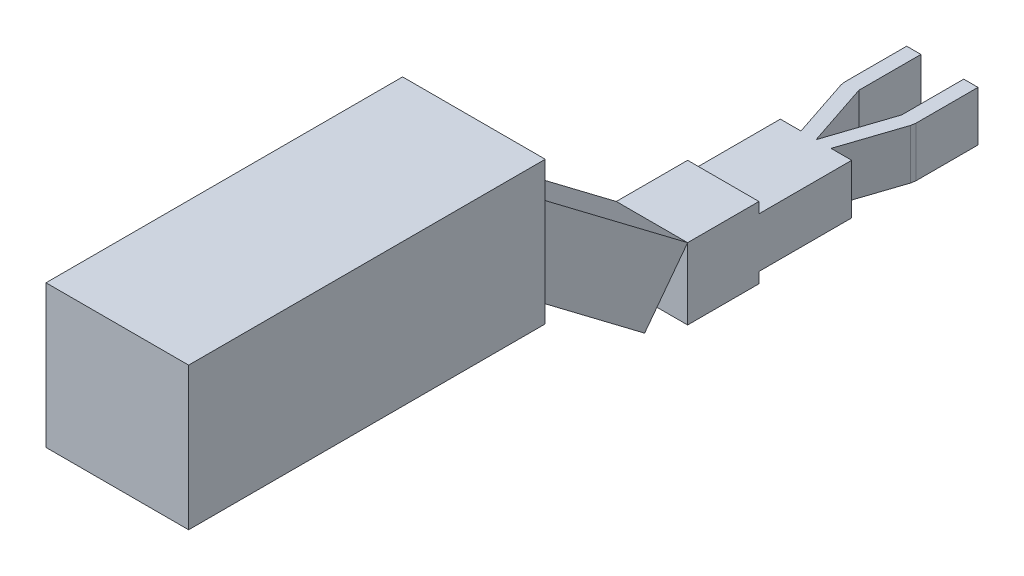
ISO-10303-21;
HEADER;
FILE_DESCRIPTION(('STEP AP214'),'2;1');
FILE_NAME('part.step','',(''),(''),'','','');
FILE_SCHEMA(('AUTOMOTIVE_DESIGN { 1 0 10303 214 1 1 1 1 }'));
ENDSEC;
DATA;
#1=APPLICATION_CONTEXT('core data for automotive mechanical design processes');
#2=APPLICATION_PROTOCOL_DEFINITION('international standard','automotive_design',2000,#1);
#3=PRODUCT_CONTEXT('',#1,'mechanical');
#4=PRODUCT('Part','Part','',(#3));
#5=PRODUCT_RELATED_PRODUCT_CATEGORY('part','',(#4));
#6=PRODUCT_DEFINITION_FORMATION('','',#4);
#7=PRODUCT_DEFINITION_CONTEXT('part definition',#1,'design');
#8=PRODUCT_DEFINITION('design','',#6,#7);
#9=PRODUCT_DEFINITION_SHAPE('','',#8);
#10=(LENGTH_UNIT() NAMED_UNIT(*) SI_UNIT(.MILLI.,.METRE.));
#11=(NAMED_UNIT(*) PLANE_ANGLE_UNIT() SI_UNIT($,.RADIAN.));
#12=(NAMED_UNIT(*) SI_UNIT($,.STERADIAN.) SOLID_ANGLE_UNIT());
#13=UNCERTAINTY_MEASURE_WITH_UNIT(LENGTH_MEASURE(1.E-05),#10,'distance_accuracy_value','');
#14=(GEOMETRIC_REPRESENTATION_CONTEXT(3) GLOBAL_UNCERTAINTY_ASSIGNED_CONTEXT((#13)) GLOBAL_UNIT_ASSIGNED_CONTEXT((#10,
#11,#12)) REPRESENTATION_CONTEXT('',''));
#15=CARTESIAN_POINT('',(0.,0.,0.));
#16=DIRECTION('',(0.,0.,1.));
#17=DIRECTION('',(1.,0.,0.));
#18=AXIS2_PLACEMENT_3D('',#15,#16,#17);
#19=CARTESIAN_POINT('',(150.,186.100667301287,635.399647205051));
#20=DIRECTION('',(0.,0.,-1.));
#21=DIRECTION('',(-1.,0.,0.));
#22=AXIS2_PLACEMENT_3D('',#19,#20,#21);
#23=PLANE('',#22);
#24=DIRECTION('',(0.,-1.,0.));
#25=VECTOR('',#24,1.);
#26=CARTESIAN_POINT('',(-50.,186.100667301287,635.399647205051));
#27=LINE('',#26,#25);
#28=CARTESIAN_POINT('',(-50.,386.100667301287,635.399647205051));
#29=VERTEX_POINT('',#28);
#30=CARTESIAN_POINT('',(-50.,186.100667301287,635.399647205051));
#31=VERTEX_POINT('',#30);
#32=EDGE_CURVE('E108',#29,#31,#27,.T.);
#33=ORIENTED_EDGE('',*,*,#32,.F.);
#34=DIRECTION('',(-1.,0.,0.));
#35=VECTOR('',#34,1.);
#36=CARTESIAN_POINT('',(150.,386.100667301287,635.399647205051));
#37=LINE('',#36,#35);
#38=CARTESIAN_POINT('',(150.,386.100667301287,635.399647205051));
#39=VERTEX_POINT('',#38);
#40=EDGE_CURVE('E12',#39,#29,#37,.T.);
#41=ORIENTED_EDGE('',*,*,#40,.F.);
#42=DIRECTION('',(0.,-1.,0.));
#43=VECTOR('',#42,1.);
#44=CARTESIAN_POINT('',(150.,186.100667301287,635.399647205051));
#45=LINE('',#44,#43);
#46=CARTESIAN_POINT('',(150.,186.100667301287,635.399647205051));
#47=VERTEX_POINT('',#46);
#48=EDGE_CURVE('E102',#39,#47,#45,.T.);
#49=ORIENTED_EDGE('',*,*,#48,.T.);
#50=DIRECTION('',(-1.,0.,0.));
#51=VECTOR('',#50,1.);
#52=CARTESIAN_POINT('',(150.,186.100667301287,635.399647205051));
#53=LINE('',#52,#51);
#54=EDGE_CURVE('E47',#47,#31,#53,.T.);
#55=ORIENTED_EDGE('',*,*,#54,.T.);
#56=EDGE_LOOP('',(#33,#41,#49,#55));
#57=FACE_BOUND('',#56,.T.);
#58=ADVANCED_FACE('F44',(#57),#23,.T.);
#59=CARTESIAN_POINT('',(150.,386.100667301287,635.399647205051));
#60=DIRECTION('',(0.,1.,0.));
#61=DIRECTION('',(-1.,0.,0.));
#62=AXIS2_PLACEMENT_3D('',#59,#60,#61);
#63=PLANE('',#62);
#64=DIRECTION('',(0.,0.,-1.));
#65=VECTOR('',#64,1.);
#66=CARTESIAN_POINT('',(-50.,386.100667301287,635.399647205051));
#67=LINE('',#66,#65);
#68=CARTESIAN_POINT('',(-49.9999999999999,386.100667301287,1135.39964720505));
#69=VERTEX_POINT('',#68);
#70=EDGE_CURVE('E104',#69,#29,#67,.T.);
#71=ORIENTED_EDGE('',*,*,#70,.F.);
#72=DIRECTION('',(-1.,0.,0.));
#73=VECTOR('',#72,1.);
#74=CARTESIAN_POINT('',(150.,386.100667301287,1135.39964720505));
#75=LINE('',#74,#73);
#76=CARTESIAN_POINT('',(150.,386.100667301287,1135.39964720505));
#77=VERTEX_POINT('',#76);
#78=EDGE_CURVE('E53',#77,#69,#75,.T.);
#79=ORIENTED_EDGE('',*,*,#78,.F.);
#80=DIRECTION('',(0.,0.,-1.));
#81=VECTOR('',#80,1.);
#82=CARTESIAN_POINT('',(150.,386.100667301287,635.399647205051));
#83=LINE('',#82,#81);
#84=EDGE_CURVE('E99',#77,#39,#83,.T.);
#85=ORIENTED_EDGE('',*,*,#84,.T.);
#86=ORIENTED_EDGE('',*,*,#40,.T.);
#87=EDGE_LOOP('',(#71,#79,#85,#86));
#88=FACE_BOUND('',#87,.T.);
#89=ADVANCED_FACE('F118',(#88),#63,.T.);
#90=CARTESIAN_POINT('',(150.,186.100667301287,1135.39964720505));
#91=DIRECTION('',(0.,0.,1.));
#92=DIRECTION('',(1.,0.,0.));
#93=AXIS2_PLACEMENT_3D('',#90,#91,#92);
#94=PLANE('',#93);
#95=DIRECTION('',(0.,1.,0.));
#96=VECTOR('',#95,1.);
#97=CARTESIAN_POINT('',(-49.9999999999999,186.100667301287,1135.39964720505));
#98=LINE('',#97,#96);
#99=CARTESIAN_POINT('',(-49.9999999999999,186.100667301287,1135.39964720505));
#100=VERTEX_POINT('',#99);
#101=EDGE_CURVE('E94',#100,#69,#98,.T.);
#102=ORIENTED_EDGE('',*,*,#101,.F.);
#103=DIRECTION('',(-1.,0.,0.));
#104=VECTOR('',#103,1.);
#105=CARTESIAN_POINT('',(150.,186.100667301287,1135.39964720505));
#106=LINE('',#105,#104);
#107=CARTESIAN_POINT('',(150.,186.100667301287,1135.39964720505));
#108=VERTEX_POINT('',#107);
#109=EDGE_CURVE('E89',#108,#100,#106,.T.);
#110=ORIENTED_EDGE('',*,*,#109,.F.);
#111=DIRECTION('',(0.,1.,0.));
#112=VECTOR('',#111,1.);
#113=CARTESIAN_POINT('',(150.,186.100667301287,1135.39964720505));
#114=LINE('',#113,#112);
#115=EDGE_CURVE('E92',#108,#77,#114,.T.);
#116=ORIENTED_EDGE('',*,*,#115,.T.);
#117=ORIENTED_EDGE('',*,*,#78,.T.);
#118=EDGE_LOOP('',(#102,#110,#116,#117));
#119=FACE_BOUND('',#118,.T.);
#120=ADVANCED_FACE('F91',(#119),#94,.T.);
#121=CARTESIAN_POINT('',(150.,186.100667301287,635.399647205051));
#122=DIRECTION('',(0.,-1.,0.));
#123=DIRECTION('',(1.,0.,0.));
#124=AXIS2_PLACEMENT_3D('',#121,#122,#123);
#125=PLANE('',#124);
#126=DIRECTION('',(0.,0.,1.));
#127=VECTOR('',#126,1.);
#128=CARTESIAN_POINT('',(-50.,186.100667301287,635.399647205051));
#129=LINE('',#128,#127);
#130=EDGE_CURVE('E111',#31,#100,#129,.T.);
#131=ORIENTED_EDGE('',*,*,#130,.F.);
#132=ORIENTED_EDGE('',*,*,#54,.F.);
#133=DIRECTION('',(0.,0.,1.));
#134=VECTOR('',#133,1.);
#135=CARTESIAN_POINT('',(150.,186.100667301287,635.399647205051));
#136=LINE('',#135,#134);
#137=EDGE_CURVE('E98',#47,#108,#136,.T.);
#138=ORIENTED_EDGE('',*,*,#137,.T.);
#139=ORIENTED_EDGE('',*,*,#109,.T.);
#140=EDGE_LOOP('',(#131,#132,#138,#139));
#141=FACE_BOUND('',#140,.T.);
#142=ADVANCED_FACE('F101',(#141),#125,.T.);
#143=CARTESIAN_POINT('',(150.,0.,0.));
#144=DIRECTION('',(1.,0.,0.));
#145=DIRECTION('',(0.,0.,-1.));
#146=AXIS2_PLACEMENT_3D('',#143,#144,#145);
#147=PLANE('',#146);
#148=ORIENTED_EDGE('',*,*,#48,.F.);
#149=ORIENTED_EDGE('',*,*,#84,.F.);
#150=ORIENTED_EDGE('',*,*,#115,.F.);
#151=ORIENTED_EDGE('',*,*,#137,.F.);
#152=EDGE_LOOP('',(#148,#149,#150,#151));
#153=FACE_BOUND('',#152,.T.);
#154=ADVANCED_FACE('F97',(#153),#147,.T.);
#155=CARTESIAN_POINT('',(-50.,0.,0.));
#156=DIRECTION('',(1.,0.,0.));
#157=DIRECTION('',(0.,0.,-1.));
#158=AXIS2_PLACEMENT_3D('',#155,#156,#157);
#159=PLANE('',#158);
#160=ORIENTED_EDGE('',*,*,#32,.T.);
#161=ORIENTED_EDGE('',*,*,#130,.T.);
#162=ORIENTED_EDGE('',*,*,#101,.T.);
#163=ORIENTED_EDGE('',*,*,#70,.T.);
#164=EDGE_LOOP('',(#160,#161,#162,#163));
#165=FACE_BOUND('',#164,.T.);
#166=ADVANCED_FACE('F117',(#165),#159,.F.);
#167=CLOSED_SHELL('',(#58,#89,#120,#142,#154,#166));
#168=MANIFOLD_SOLID_BREP('B2',#167);
#169=CARTESIAN_POINT('',(50.,85.,335.768782521129));
#170=DIRECTION('',(0.,0.797791926750478,-0.602932866587782));
#171=DIRECTION('',(0.,0.602932866587782,0.797791926750478));
#172=AXIS2_PLACEMENT_3D('',#169,#170,#171);
#173=PLANE('',#172);
#174=DIRECTION('',(0.,-0.602932866587782,-0.797791926750478));
#175=VECTOR('',#174,1.);
#176=CARTESIAN_POINT('',(-50.,85.,335.768782521129));
#177=LINE('',#176,#175);
#178=CARTESIAN_POINT('',(-50.,265.879859976335,575.106360546273));
#179=VERTEX_POINT('',#178);
#180=CARTESIAN_POINT('',(-50.,85.,335.768782521129));
#181=VERTEX_POINT('',#180);
#182=EDGE_CURVE('E241',#179,#181,#177,.T.);
#183=ORIENTED_EDGE('',*,*,#182,.F.);
#184=DIRECTION('',(-1.,0.,0.));
#185=VECTOR('',#184,1.);
#186=CARTESIAN_POINT('',(50.,265.879859976335,575.106360546273));
#187=LINE('',#186,#185);
#188=CARTESIAN_POINT('',(50.,265.879859976335,575.106360546273));
#189=VERTEX_POINT('',#188);
#190=EDGE_CURVE('E42',#189,#179,#187,.T.);
#191=ORIENTED_EDGE('',*,*,#190,.F.);
#192=DIRECTION('',(0.,-0.602932866587782,-0.797791926750478));
#193=VECTOR('',#192,1.);
#194=CARTESIAN_POINT('',(50.,85.,335.768782521129));
#195=LINE('',#194,#193);
#196=CARTESIAN_POINT('',(50.,85.,335.768782521129));
#197=VERTEX_POINT('',#196);
#198=EDGE_CURVE('E235',#189,#197,#195,.T.);
#199=ORIENTED_EDGE('',*,*,#198,.T.);
#200=DIRECTION('',(-1.,0.,0.));
#201=VECTOR('',#200,1.);
#202=CARTESIAN_POINT('',(50.,85.,335.768782521129));
#203=LINE('',#202,#201);
#204=EDGE_CURVE('E180',#197,#181,#203,.T.);
#205=ORIENTED_EDGE('',*,*,#204,.T.);
#206=EDGE_LOOP('',(#183,#191,#199,#205));
#207=FACE_BOUND('',#206,.T.);
#208=ADVANCED_FACE('F177',(#207),#173,.T.);
#209=CARTESIAN_POINT('',(50.,265.879859976335,575.106360546273));
#210=DIRECTION('',(0.,0.602932866587782,0.797791926750478));
#211=DIRECTION('',(0.,-0.797791926750478,0.602932866587782));
#212=AXIS2_PLACEMENT_3D('',#209,#210,#211);
#213=PLANE('',#212);
#214=DIRECTION('',(0.,0.797791926750478,-0.602932866587782));
#215=VECTOR('',#214,1.);
#216=CARTESIAN_POINT('',(-50.,265.879859976335,575.106360546273));
#217=LINE('',#216,#215);
#218=CARTESIAN_POINT('',(-50.,186.100667301287,635.399647205051));
#219=VERTEX_POINT('',#218);
#220=EDGE_CURVE('E237',#219,#179,#217,.T.);
#221=ORIENTED_EDGE('',*,*,#220,.F.);
#222=DIRECTION('',(-1.,0.,0.));
#223=VECTOR('',#222,1.);
#224=CARTESIAN_POINT('',(50.0000000000001,186.100667301287,635.399647205051));
#225=LINE('',#224,#223);
#226=CARTESIAN_POINT('',(50.0000000000001,186.100667301287,635.399647205051));
#227=VERTEX_POINT('',#226);
#228=EDGE_CURVE('E186',#227,#219,#225,.T.);
#229=ORIENTED_EDGE('',*,*,#228,.F.);
#230=DIRECTION('',(0.,0.797791926750478,-0.602932866587782));
#231=VECTOR('',#230,1.);
#232=CARTESIAN_POINT('',(50.,265.879859976335,575.106360546273));
#233=LINE('',#232,#231);
#234=EDGE_CURVE('E232',#227,#189,#233,.T.);
#235=ORIENTED_EDGE('',*,*,#234,.T.);
#236=ORIENTED_EDGE('',*,*,#190,.T.);
#237=EDGE_LOOP('',(#221,#229,#235,#236));
#238=FACE_BOUND('',#237,.T.);
#239=ADVANCED_FACE('F251',(#238),#213,.T.);
#240=CARTESIAN_POINT('',(50.,5.22080732495214,396.062069179907));
#241=DIRECTION('',(0.,-0.797791926750478,0.602932866587782));
#242=DIRECTION('',(0.,-0.602932866587782,-0.797791926750478));
#243=AXIS2_PLACEMENT_3D('',#240,#241,#242);
#244=PLANE('',#243);
#245=DIRECTION('',(0.,0.602932866587782,0.797791926750478));
#246=VECTOR('',#245,1.);
#247=CARTESIAN_POINT('',(-50.,5.22080732495214,396.062069179907));
#248=LINE('',#247,#246);
#249=CARTESIAN_POINT('',(-50.,5.22080732495214,396.062069179907));
#250=VERTEX_POINT('',#249);
#251=EDGE_CURVE('E227',#250,#219,#248,.T.);
#252=ORIENTED_EDGE('',*,*,#251,.F.);
#253=DIRECTION('',(-1.,0.,0.));
#254=VECTOR('',#253,1.);
#255=CARTESIAN_POINT('',(50.,5.22080732495214,396.062069179907));
#256=LINE('',#255,#254);
#257=CARTESIAN_POINT('',(50.,5.22080732495214,396.062069179907));
#258=VERTEX_POINT('',#257);
#259=EDGE_CURVE('E222',#258,#250,#256,.T.);
#260=ORIENTED_EDGE('',*,*,#259,.F.);
#261=DIRECTION('',(0.,0.602932866587782,0.797791926750478));
#262=VECTOR('',#261,1.);
#263=CARTESIAN_POINT('',(50.,5.22080732495214,396.062069179907));
#264=LINE('',#263,#262);
#265=EDGE_CURVE('E225',#258,#227,#264,.T.);
#266=ORIENTED_EDGE('',*,*,#265,.T.);
#267=ORIENTED_EDGE('',*,*,#228,.T.);
#268=EDGE_LOOP('',(#252,#260,#266,#267));
#269=FACE_BOUND('',#268,.T.);
#270=ADVANCED_FACE('F224',(#269),#244,.T.);
#271=CARTESIAN_POINT('',(50.,85.,335.768782521129));
#272=DIRECTION('',(0.,-0.602932866587781,-0.797791926750478));
#273=DIRECTION('',(0.,0.797791926750478,-0.602932866587781));
#274=AXIS2_PLACEMENT_3D('',#271,#272,#273);
#275=PLANE('',#274);
#276=DIRECTION('',(0.,-0.797791926750478,0.602932866587781));
#277=VECTOR('',#276,1.);
#278=CARTESIAN_POINT('',(-50.,85.,335.768782521129));
#279=LINE('',#278,#277);
#280=EDGE_CURVE('E244',#181,#250,#279,.T.);
#281=ORIENTED_EDGE('',*,*,#280,.F.);
#282=ORIENTED_EDGE('',*,*,#204,.F.);
#283=DIRECTION('',(0.,-0.797791926750478,0.602932866587781));
#284=VECTOR('',#283,1.);
#285=CARTESIAN_POINT('',(50.,85.,335.768782521129));
#286=LINE('',#285,#284);
#287=EDGE_CURVE('E231',#197,#258,#286,.T.);
#288=ORIENTED_EDGE('',*,*,#287,.T.);
#289=ORIENTED_EDGE('',*,*,#259,.T.);
#290=EDGE_LOOP('',(#281,#282,#288,#289));
#291=FACE_BOUND('',#290,.T.);
#292=ADVANCED_FACE('F234',(#291),#275,.T.);
#293=CARTESIAN_POINT('',(50.,0.,0.));
#294=DIRECTION('',(1.,0.,0.));
#295=DIRECTION('',(0.,0.,-1.));
#296=AXIS2_PLACEMENT_3D('',#293,#294,#295);
#297=PLANE('',#296);
#298=ORIENTED_EDGE('',*,*,#198,.F.);
#299=ORIENTED_EDGE('',*,*,#234,.F.);
#300=ORIENTED_EDGE('',*,*,#265,.F.);
#301=ORIENTED_EDGE('',*,*,#287,.F.);
#302=EDGE_LOOP('',(#298,#299,#300,#301));
#303=FACE_BOUND('',#302,.T.);
#304=ADVANCED_FACE('F230',(#303),#297,.T.);
#305=CARTESIAN_POINT('',(-50.,0.,0.));
#306=DIRECTION('',(1.,0.,0.));
#307=DIRECTION('',(0.,0.,-1.));
#308=AXIS2_PLACEMENT_3D('',#305,#306,#307);
#309=PLANE('',#308);
#310=ORIENTED_EDGE('',*,*,#182,.T.);
#311=ORIENTED_EDGE('',*,*,#280,.T.);
#312=ORIENTED_EDGE('',*,*,#251,.T.);
#313=ORIENTED_EDGE('',*,*,#220,.T.);
#314=EDGE_LOOP('',(#310,#311,#312,#313));
#315=FACE_BOUND('',#314,.T.);
#316=ADVANCED_FACE('F250',(#315),#309,.F.);
#317=CLOSED_SHELL('',(#208,#239,#270,#292,#304,#316));
#318=MANIFOLD_SOLID_BREP('B6',#317);
#319=CARTESIAN_POINT('',(-50.,70.,-71.3699993654707));
#320=DIRECTION('',(1.,0.,0.));
#321=DIRECTION('',(0.,0.,-1.));
#322=AXIS2_PLACEMENT_3D('',#319,#320,#321);
#323=PLANE('',#322);
#324=DIRECTION('',(0.,0.,1.));
#325=VECTOR('',#324,1.);
#326=CARTESIAN_POINT('',(-50.,0.,-71.3699993654707));
#327=LINE('',#326,#325);
#328=CARTESIAN_POINT('',(-50.,0.,-71.3699993654707));
#329=VERTEX_POINT('',#328);
#330=CARTESIAN_POINT('',(-50.,0.,15.6300006345293));
#331=VERTEX_POINT('',#330);
#332=EDGE_CURVE('E447',#329,#331,#327,.T.);
#333=ORIENTED_EDGE('',*,*,#332,.T.);
#334=DIRECTION('',(0.,-1.,0.));
#335=VECTOR('',#334,1.);
#336=CARTESIAN_POINT('',(-50.,70.,15.6300006345293));
#337=LINE('',#336,#335);
#338=CARTESIAN_POINT('',(-50.,70.,15.6300006345293));
#339=VERTEX_POINT('',#338);
#340=EDGE_CURVE('E175',#339,#331,#337,.T.);
#341=ORIENTED_EDGE('',*,*,#340,.F.);
#342=DIRECTION('',(0.,0.,1.));
#343=VECTOR('',#342,1.);
#344=CARTESIAN_POINT('',(-50.,70.,-71.3699993654707));
#345=LINE('',#344,#343);
#346=CARTESIAN_POINT('',(-50.,70.,-71.3699993654707));
#347=VERTEX_POINT('',#346);
#348=EDGE_CURVE('E497',#347,#339,#345,.T.);
#349=ORIENTED_EDGE('',*,*,#348,.F.);
#350=DIRECTION('',(0.,-1.,0.));
#351=VECTOR('',#350,1.);
#352=CARTESIAN_POINT('',(-50.,70.,-71.3699993654707));
#353=LINE('',#352,#351);
#354=EDGE_CURVE('E443',#347,#329,#353,.T.);
#355=ORIENTED_EDGE('',*,*,#354,.T.);
#356=EDGE_LOOP('',(#333,#341,#349,#355));
#357=FACE_BOUND('',#356,.T.);
#358=ADVANCED_FACE('F301',(#357),#323,.F.);
#359=CARTESIAN_POINT('',(-48.9765856603368,70.,21.9457901082135));
#360=DIRECTION('',(0.98712443061066,0.,-0.159954238742149));
#361=DIRECTION('',(-0.159954238742149,0.,-0.98712443061066));
#362=AXIS2_PLACEMENT_3D('',#359,#360,#361);
#363=PLANE('',#362);
#364=DIRECTION('',(0.159954238742149,0.,0.98712443061066));
#365=VECTOR('',#364,1.);
#366=CARTESIAN_POINT('',(-48.9765856603368,0.,21.9457901082135));
#367=LINE('',#366,#365);
#368=CARTESIAN_POINT('',(-48.9765856603368,0.,21.9457901082135));
#369=VERTEX_POINT('',#368);
#370=EDGE_CURVE('E450',#331,#369,#367,.T.);
#371=ORIENTED_EDGE('',*,*,#370,.T.);
#372=DIRECTION('',(0.,-1.,0.));
#373=VECTOR('',#372,1.);
#374=CARTESIAN_POINT('',(-48.9765856603368,70.,21.9457901082135));
#375=LINE('',#374,#373);
#376=CARTESIAN_POINT('',(-48.9765856603368,70.,21.9457901082135));
#377=VERTEX_POINT('',#376);
#378=EDGE_CURVE('E310',#377,#369,#375,.T.);
#379=ORIENTED_EDGE('',*,*,#378,.F.);
#380=DIRECTION('',(0.159954238742149,0.,0.98712443061066));
#381=VECTOR('',#380,1.);
#382=CARTESIAN_POINT('',(-48.9765856603368,70.,21.9457901082135));
#383=LINE('',#382,#381);
#384=EDGE_CURVE('E384',#339,#377,#383,.T.);
#385=ORIENTED_EDGE('',*,*,#384,.F.);
#386=ORIENTED_EDGE('',*,*,#340,.T.);
#387=EDGE_LOOP('',(#371,#379,#385,#386));
#388=FACE_BOUND('',#387,.T.);
#389=ADVANCED_FACE('F578',(#388),#363,.F.);
#390=CARTESIAN_POINT('',(-21.0786074565587,70.,105.768782521129));
#391=DIRECTION('',(0.948829283016839,0.,-0.315789473684211));
#392=DIRECTION('',(-0.315789473684211,0.,-0.948829283016839));
#393=AXIS2_PLACEMENT_3D('',#390,#391,#392);
#394=PLANE('',#393);
#395=DIRECTION('',(0.31578947368421,0.,0.948829283016839));
#396=VECTOR('',#395,1.);
#397=CARTESIAN_POINT('',(-21.0786074565587,0.,105.768782521129));
#398=LINE('',#397,#396);
#399=CARTESIAN_POINT('',(-21.0786074565587,0.,105.768782521129));
#400=VERTEX_POINT('',#399);
#401=EDGE_CURVE('E453',#369,#400,#398,.T.);
#402=ORIENTED_EDGE('',*,*,#401,.T.);
#403=DIRECTION('',(0.,-1.,0.));
#404=VECTOR('',#403,1.);
#405=CARTESIAN_POINT('',(-21.0786074565587,70.,105.768782521129));
#406=LINE('',#405,#404);
#407=CARTESIAN_POINT('',(-21.0786074565587,70.,105.768782521129));
#408=VERTEX_POINT('',#407);
#409=EDGE_CURVE('E522',#408,#400,#406,.T.);
#410=ORIENTED_EDGE('',*,*,#409,.F.);
#411=DIRECTION('',(0.31578947368421,0.,0.948829283016839));
#412=VECTOR('',#411,1.);
#413=CARTESIAN_POINT('',(-21.0786074565587,70.,105.768782521129));
#414=LINE('',#413,#412);
#415=EDGE_CURVE('E814',#377,#408,#414,.T.);
#416=ORIENTED_EDGE('',*,*,#415,.F.);
#417=ORIENTED_EDGE('',*,*,#378,.T.);
#418=EDGE_LOOP('',(#402,#410,#416,#417));
#419=FACE_BOUND('',#418,.T.);
#420=ADVANCED_FACE('F582',(#419),#394,.F.);
#421=CARTESIAN_POINT('',(-50.,70.,105.768782521129));
#422=DIRECTION('',(0.,0.,1.));
#423=DIRECTION('',(1.,0.,0.));
#424=AXIS2_PLACEMENT_3D('',#421,#422,#423);
#425=PLANE('',#424);
#426=DIRECTION('',(-1.,0.,0.));
#427=VECTOR('',#426,1.);
#428=CARTESIAN_POINT('',(-50.,0.,105.768782521129));
#429=LINE('',#428,#427);
#430=CARTESIAN_POINT('',(-50.,0.,105.768782521129));
#431=VERTEX_POINT('',#430);
#432=EDGE_CURVE('E455',#400,#431,#429,.T.);
#433=ORIENTED_EDGE('',*,*,#432,.T.);
#434=DIRECTION('',(0.,-1.,0.));
#435=VECTOR('',#434,1.);
#436=CARTESIAN_POINT('',(-50.,70.,105.768782521129));
#437=LINE('',#436,#435);
#438=CARTESIAN_POINT('',(-50.,70.,105.768782521129));
#439=VERTEX_POINT('',#438);
#440=EDGE_CURVE('E519',#439,#431,#437,.T.);
#441=ORIENTED_EDGE('',*,*,#440,.F.);
#442=DIRECTION('',(-1.,0.,0.));
#443=VECTOR('',#442,1.);
#444=CARTESIAN_POINT('',(-50.,70.,105.768782521129));
#445=LINE('',#444,#443);
#446=EDGE_CURVE('E537',#408,#439,#445,.T.);
#447=ORIENTED_EDGE('',*,*,#446,.F.);
#448=ORIENTED_EDGE('',*,*,#409,.T.);
#449=EDGE_LOOP('',(#433,#441,#447,#448));
#450=FACE_BOUND('',#449,.T.);
#451=ADVANCED_FACE('F586',(#450),#425,.F.);
#452=CARTESIAN_POINT('',(-50.,70.,105.768782521129));
#453=DIRECTION('',(1.,0.,0.));
#454=DIRECTION('',(0.,0.,-1.));
#455=AXIS2_PLACEMENT_3D('',#452,#453,#454);
#456=PLANE('',#455);
#457=DIRECTION('',(0.,0.,1.));
#458=VECTOR('',#457,1.);
#459=CARTESIAN_POINT('',(-50.,0.,105.768782521129));
#460=LINE('',#459,#458);
#461=CARTESIAN_POINT('',(-50.,0.,235.768782521129));
#462=VERTEX_POINT('',#461);
#463=EDGE_CURVE('E457',#431,#462,#460,.T.);
#464=ORIENTED_EDGE('',*,*,#463,.T.);
#465=DIRECTION('',(0.,-1.,0.));
#466=VECTOR('',#465,1.);
#467=CARTESIAN_POINT('',(-50.,85.,235.768782521129));
#468=LINE('',#467,#466);
#469=CARTESIAN_POINT('',(-50.,-15.,235.768782521129));
#470=VERTEX_POINT('',#469);
#471=EDGE_CURVE('E718',#462,#470,#468,.T.);
#472=ORIENTED_EDGE('',*,*,#471,.T.);
#473=DIRECTION('',(0.,0.,-1.));
#474=VECTOR('',#473,1.);
#475=CARTESIAN_POINT('',(-50.,-15.,335.768782521129));
#476=LINE('',#475,#474);
#477=CARTESIAN_POINT('',(-50.,-15.,335.768782521129));
#478=VERTEX_POINT('',#477);
#479=EDGE_CURVE('E780',#478,#470,#476,.T.);
#480=ORIENTED_EDGE('',*,*,#479,.F.);
#481=DIRECTION('',(0.,-1.,0.));
#482=VECTOR('',#481,1.);
#483=CARTESIAN_POINT('',(-50.,85.,335.768782521129));
#484=LINE('',#483,#482);
#485=CARTESIAN_POINT('',(-50.,85.,335.768782521129));
#486=VERTEX_POINT('',#485);
#487=EDGE_CURVE('E767',#486,#478,#484,.T.);
#488=ORIENTED_EDGE('',*,*,#487,.F.);
#489=DIRECTION('',(0.,0.,-1.));
#490=VECTOR('',#489,1.);
#491=CARTESIAN_POINT('',(-50.,85.,335.768782521129));
#492=LINE('',#491,#490);
#493=CARTESIAN_POINT('',(-50.,85.,235.768782521129));
#494=VERTEX_POINT('',#493);
#495=EDGE_CURVE('E765',#486,#494,#492,.T.);
#496=ORIENTED_EDGE('',*,*,#495,.T.);
#497=CARTESIAN_POINT('',(-50.,70.,235.768782521129));
#498=VERTEX_POINT('',#497);
#499=EDGE_CURVE('E729',#494,#498,#468,.T.);
#500=ORIENTED_EDGE('',*,*,#499,.T.);
#501=DIRECTION('',(0.,0.,1.));
#502=VECTOR('',#501,1.);
#503=CARTESIAN_POINT('',(-50.,70.,105.768782521129));
#504=LINE('',#503,#502);
#505=EDGE_CURVE('E532',#439,#498,#504,.T.);
#506=ORIENTED_EDGE('',*,*,#505,.F.);
#507=ORIENTED_EDGE('',*,*,#440,.T.);
#508=EDGE_LOOP('',(#464,#472,#480,#488,#496,#500,#506,#507));
#509=FACE_BOUND('',#508,.T.);
#510=ADVANCED_FACE('F592',(#509),#456,.F.);
#511=CARTESIAN_POINT('',(50.,70.,105.768782521129));
#512=DIRECTION('',(-1.,0.,0.));
#513=DIRECTION('',(0.,0.,1.));
#514=AXIS2_PLACEMENT_3D('',#511,#512,#513);
#515=PLANE('',#514);
#516=DIRECTION('',(0.,0.,-1.));
#517=VECTOR('',#516,1.);
#518=CARTESIAN_POINT('',(50.,0.,105.768782521129));
#519=LINE('',#518,#517);
#520=CARTESIAN_POINT('',(50.,0.,235.768782521129));
#521=VERTEX_POINT('',#520);
#522=CARTESIAN_POINT('',(50.,0.,105.768782521129));
#523=VERTEX_POINT('',#522);
#524=EDGE_CURVE('E466',#521,#523,#519,.T.);
#525=ORIENTED_EDGE('',*,*,#524,.T.);
#526=DIRECTION('',(0.,-1.,0.));
#527=VECTOR('',#526,1.);
#528=CARTESIAN_POINT('',(50.,70.,105.768782521129));
#529=LINE('',#528,#527);
#530=CARTESIAN_POINT('',(50.,70.,105.768782521129));
#531=VERTEX_POINT('',#530);
#532=EDGE_CURVE('E517',#531,#523,#529,.T.);
#533=ORIENTED_EDGE('',*,*,#532,.F.);
#534=DIRECTION('',(0.,0.,-1.));
#535=VECTOR('',#534,1.);
#536=CARTESIAN_POINT('',(50.,70.,105.768782521129));
#537=LINE('',#536,#535);
#538=CARTESIAN_POINT('',(50.,70.,235.768782521129));
#539=VERTEX_POINT('',#538);
#540=EDGE_CURVE('E531',#539,#531,#537,.T.);
#541=ORIENTED_EDGE('',*,*,#540,.F.);
#542=DIRECTION('',(0.,1.,0.));
#543=VECTOR('',#542,1.);
#544=CARTESIAN_POINT('',(50.,85.,235.768782521129));
#545=LINE('',#544,#543);
#546=CARTESIAN_POINT('',(50.,85.,235.768782521129));
#547=VERTEX_POINT('',#546);
#548=EDGE_CURVE('E777',#539,#547,#545,.T.);
#549=ORIENTED_EDGE('',*,*,#548,.T.);
#550=DIRECTION('',(0.,0.,-1.));
#551=VECTOR('',#550,1.);
#552=CARTESIAN_POINT('',(50.,85.,335.768782521129));
#553=LINE('',#552,#551);
#554=CARTESIAN_POINT('',(50.,85.,335.768782521129));
#555=VERTEX_POINT('',#554);
#556=EDGE_CURVE('E451',#555,#547,#553,.T.);
#557=ORIENTED_EDGE('',*,*,#556,.F.);
#558=DIRECTION('',(0.,1.,0.));
#559=VECTOR('',#558,1.);
#560=CARTESIAN_POINT('',(50.,85.,335.768782521129));
#561=LINE('',#560,#559);
#562=CARTESIAN_POINT('',(50.,-15.,335.768782521129));
#563=VERTEX_POINT('',#562);
#564=EDGE_CURVE('E768',#563,#555,#561,.T.);
#565=ORIENTED_EDGE('',*,*,#564,.F.);
#566=DIRECTION('',(0.,0.,-1.));
#567=VECTOR('',#566,1.);
#568=CARTESIAN_POINT('',(50.,-15.,335.768782521129));
#569=LINE('',#568,#567);
#570=CARTESIAN_POINT('',(50.,-15.,235.768782521129));
#571=VERTEX_POINT('',#570);
#572=EDGE_CURVE('E802',#563,#571,#569,.T.);
#573=ORIENTED_EDGE('',*,*,#572,.T.);
#574=EDGE_CURVE('E784',#571,#521,#545,.T.);
#575=ORIENTED_EDGE('',*,*,#574,.T.);
#576=EDGE_LOOP('',(#525,#533,#541,#549,#557,#565,#573,#575));
#577=FACE_BOUND('',#576,.T.);
#578=ADVANCED_FACE('F596',(#577),#515,.F.);
#579=CARTESIAN_POINT('',(21.0786074565587,70.,105.768782521129));
#580=DIRECTION('',(0.,0.,1.));
#581=DIRECTION('',(1.,0.,0.));
#582=AXIS2_PLACEMENT_3D('',#579,#580,#581);
#583=PLANE('',#582);
#584=DIRECTION('',(-1.,0.,0.));
#585=VECTOR('',#584,1.);
#586=CARTESIAN_POINT('',(21.0786074565587,0.,105.768782521129));
#587=LINE('',#586,#585);
#588=CARTESIAN_POINT('',(21.0786074565587,0.,105.768782521129));
#589=VERTEX_POINT('',#588);
#590=EDGE_CURVE('E460',#523,#589,#587,.T.);
#591=ORIENTED_EDGE('',*,*,#590,.T.);
#592=DIRECTION('',(0.,-1.,0.));
#593=VECTOR('',#592,1.);
#594=CARTESIAN_POINT('',(21.0786074565587,70.,105.768782521129));
#595=LINE('',#594,#593);
#596=CARTESIAN_POINT('',(21.0786074565587,70.,105.768782521129));
#597=VERTEX_POINT('',#596);
#598=EDGE_CURVE('E515',#597,#589,#595,.T.);
#599=ORIENTED_EDGE('',*,*,#598,.F.);
#600=DIRECTION('',(-1.,0.,0.));
#601=VECTOR('',#600,1.);
#602=CARTESIAN_POINT('',(21.0786074565587,70.,105.768782521129));
#603=LINE('',#602,#601);
#604=EDGE_CURVE('E539',#531,#597,#603,.T.);
#605=ORIENTED_EDGE('',*,*,#604,.F.);
#606=ORIENTED_EDGE('',*,*,#532,.T.);
#607=EDGE_LOOP('',(#591,#599,#605,#606));
#608=FACE_BOUND('',#607,.T.);
#609=ADVANCED_FACE('F600',(#608),#583,.F.);
#610=CARTESIAN_POINT('',(21.0786074565587,70.,105.768782521129));
#611=DIRECTION('',(-0.948829283016839,0.,-0.31578947368421));
#612=DIRECTION('',(-0.31578947368421,0.,0.948829283016839));
#613=AXIS2_PLACEMENT_3D('',#610,#611,#612);
#614=PLANE('',#613);
#615=DIRECTION('',(0.31578947368421,0.,-0.948829283016839));
#616=VECTOR('',#615,1.);
#617=CARTESIAN_POINT('',(21.0786074565587,0.,105.768782521129));
#618=LINE('',#617,#616);
#619=CARTESIAN_POINT('',(48.9765856603368,0.,21.9457901082136));
#620=VERTEX_POINT('',#619);
#621=EDGE_CURVE('E474',#589,#620,#618,.T.);
#622=ORIENTED_EDGE('',*,*,#621,.T.);
#623=DIRECTION('',(0.,-1.,0.));
#624=VECTOR('',#623,1.);
#625=CARTESIAN_POINT('',(48.9765856603368,70.,21.9457901082136));
#626=LINE('',#625,#624);
#627=CARTESIAN_POINT('',(48.9765856603368,70.,21.9457901082136));
#628=VERTEX_POINT('',#627);
#629=EDGE_CURVE('E513',#628,#620,#626,.T.);
#630=ORIENTED_EDGE('',*,*,#629,.F.);
#631=DIRECTION('',(0.31578947368421,0.,-0.948829283016839));
#632=VECTOR('',#631,1.);
#633=CARTESIAN_POINT('',(21.0786074565587,70.,105.768782521129));
#634=LINE('',#633,#632);
#635=EDGE_CURVE('E541',#597,#628,#634,.T.);
#636=ORIENTED_EDGE('',*,*,#635,.F.);
#637=ORIENTED_EDGE('',*,*,#598,.T.);
#638=EDGE_LOOP('',(#622,#630,#636,#637));
#639=FACE_BOUND('',#638,.T.);
#640=ADVANCED_FACE('F603',(#639),#614,.F.);
#641=CARTESIAN_POINT('',(50.,70.,15.6300006345293));
#642=DIRECTION('',(-0.98712443061066,0.,-0.159954238742149));
#643=DIRECTION('',(-0.159954238742149,0.,0.98712443061066));
#644=AXIS2_PLACEMENT_3D('',#641,#642,#643);
#645=PLANE('',#644);
#646=DIRECTION('',(0.159954238742149,0.,-0.98712443061066));
#647=VECTOR('',#646,1.);
#648=CARTESIAN_POINT('',(50.,0.,15.6300006345293));
#649=LINE('',#648,#647);
#650=CARTESIAN_POINT('',(50.,0.,15.6300006345293));
#651=VERTEX_POINT('',#650);
#652=EDGE_CURVE('E479',#620,#651,#649,.T.);
#653=ORIENTED_EDGE('',*,*,#652,.T.);
#654=DIRECTION('',(0.,-1.,0.));
#655=VECTOR('',#654,1.);
#656=CARTESIAN_POINT('',(50.,70.,15.6300006345293));
#657=LINE('',#656,#655);
#658=CARTESIAN_POINT('',(50.,70.,15.6300006345293));
#659=VERTEX_POINT('',#658);
#660=EDGE_CURVE('E510',#659,#651,#657,.T.);
#661=ORIENTED_EDGE('',*,*,#660,.F.);
#662=DIRECTION('',(0.159954238742149,0.,-0.98712443061066));
#663=VECTOR('',#662,1.);
#664=CARTESIAN_POINT('',(50.,70.,15.6300006345293));
#665=LINE('',#664,#663);
#666=EDGE_CURVE('E543',#628,#659,#665,.T.);
#667=ORIENTED_EDGE('',*,*,#666,.F.);
#668=ORIENTED_EDGE('',*,*,#629,.T.);
#669=EDGE_LOOP('',(#653,#661,#667,#668));
#670=FACE_BOUND('',#669,.T.);
#671=ADVANCED_FACE('F606',(#670),#645,.F.);
#672=CARTESIAN_POINT('',(50.,70.,-71.3699993654707));
#673=DIRECTION('',(-1.,0.,0.));
#674=DIRECTION('',(0.,0.,1.));
#675=AXIS2_PLACEMENT_3D('',#672,#673,#674);
#676=PLANE('',#675);
#677=DIRECTION('',(0.,0.,-1.));
#678=VECTOR('',#677,1.);
#679=CARTESIAN_POINT('',(50.,0.,-71.3699993654707));
#680=LINE('',#679,#678);
#681=CARTESIAN_POINT('',(50.,0.,-71.3699993654707));
#682=VERTEX_POINT('',#681);
#683=EDGE_CURVE('E484',#651,#682,#680,.T.);
#684=ORIENTED_EDGE('',*,*,#683,.T.);
#685=DIRECTION('',(0.,-1.,0.));
#686=VECTOR('',#685,1.);
#687=CARTESIAN_POINT('',(50.,70.,-71.3699993654707));
#688=LINE('',#687,#686);
#689=CARTESIAN_POINT('',(50.,70.,-71.3699993654707));
#690=VERTEX_POINT('',#689);
#691=EDGE_CURVE('E507',#690,#682,#688,.T.);
#692=ORIENTED_EDGE('',*,*,#691,.F.);
#693=DIRECTION('',(0.,0.,-1.));
#694=VECTOR('',#693,1.);
#695=CARTESIAN_POINT('',(50.,70.,-71.3699993654707));
#696=LINE('',#695,#694);
#697=EDGE_CURVE('E545',#659,#690,#696,.T.);
#698=ORIENTED_EDGE('',*,*,#697,.F.);
#699=ORIENTED_EDGE('',*,*,#660,.T.);
#700=EDGE_LOOP('',(#684,#692,#698,#699));
#701=FACE_BOUND('',#700,.T.);
#702=ADVANCED_FACE('F609',(#701),#676,.F.);
#703=CARTESIAN_POINT('',(30.,70.,-71.3699993654707));
#704=DIRECTION('',(0.,0.,1.));
#705=DIRECTION('',(1.,0.,0.));
#706=AXIS2_PLACEMENT_3D('',#703,#704,#705);
#707=PLANE('',#706);
#708=DIRECTION('',(-1.,0.,0.));
#709=VECTOR('',#708,1.);
#710=CARTESIAN_POINT('',(30.,0.,-71.3699993654707));
#711=LINE('',#710,#709);
#712=CARTESIAN_POINT('',(30.,0.,-71.3699993654707));
#713=VERTEX_POINT('',#712);
#714=EDGE_CURVE('E488',#682,#713,#711,.T.);
#715=ORIENTED_EDGE('',*,*,#714,.T.);
#716=DIRECTION('',(0.,-1.,0.));
#717=VECTOR('',#716,1.);
#718=CARTESIAN_POINT('',(30.,70.,-71.3699993654707));
#719=LINE('',#718,#717);
#720=CARTESIAN_POINT('',(30.,70.,-71.3699993654707));
#721=VERTEX_POINT('',#720);
#722=EDGE_CURVE('E504',#721,#713,#719,.T.);
#723=ORIENTED_EDGE('',*,*,#722,.F.);
#724=DIRECTION('',(-1.,0.,0.));
#725=VECTOR('',#724,1.);
#726=CARTESIAN_POINT('',(30.,70.,-71.3699993654707));
#727=LINE('',#726,#725);
#728=EDGE_CURVE('E547',#690,#721,#727,.T.);
#729=ORIENTED_EDGE('',*,*,#728,.F.);
#730=ORIENTED_EDGE('',*,*,#691,.T.);
#731=EDGE_LOOP('',(#715,#723,#729,#730));
#732=FACE_BOUND('',#731,.T.);
#733=ADVANCED_FACE('F613',(#732),#707,.F.);
#734=CARTESIAN_POINT('',(30.,70.,-71.3699993654707));
#735=DIRECTION('',(1.,0.,0.));
#736=DIRECTION('',(0.,0.,-1.));
#737=AXIS2_PLACEMENT_3D('',#734,#735,#736);
#738=PLANE('',#737);
#739=DIRECTION('',(0.,0.,1.));
#740=VECTOR('',#739,1.);
#741=CARTESIAN_POINT('',(30.,0.,-71.3699993654707));
#742=LINE('',#741,#740);
#743=CARTESIAN_POINT('',(30.,0.,15.6300006345293));
#744=VERTEX_POINT('',#743);
#745=EDGE_CURVE('E490',#713,#744,#742,.T.);
#746=ORIENTED_EDGE('',*,*,#745,.T.);
#747=DIRECTION('',(0.,-1.,0.));
#748=VECTOR('',#747,1.);
#749=CARTESIAN_POINT('',(30.,70.,15.6300006345293));
#750=LINE('',#749,#748);
#751=CARTESIAN_POINT('',(30.,70.,15.6300006345293));
#752=VERTEX_POINT('',#751);
#753=EDGE_CURVE('E501',#752,#744,#750,.T.);
#754=ORIENTED_EDGE('',*,*,#753,.F.);
#755=DIRECTION('',(0.,0.,1.));
#756=VECTOR('',#755,1.);
#757=CARTESIAN_POINT('',(30.,70.,-71.3699993654707));
#758=LINE('',#757,#756);
#759=EDGE_CURVE('E549',#721,#752,#758,.T.);
#760=ORIENTED_EDGE('',*,*,#759,.F.);
#761=ORIENTED_EDGE('',*,*,#722,.T.);
#762=EDGE_LOOP('',(#746,#754,#760,#761));
#763=FACE_BOUND('',#762,.T.);
#764=ADVANCED_FACE('F555',(#763),#738,.F.);
#765=CARTESIAN_POINT('',(0.,70.,105.768782521129));
#766=DIRECTION('',(0.948829283016839,0.,0.31578947368421));
#767=DIRECTION('',(0.315789473684211,0.,-0.948829283016839));
#768=AXIS2_PLACEMENT_3D('',#765,#766,#767);
#769=PLANE('',#768);
#770=DIRECTION('',(-0.315789473684211,0.,0.948829283016839));
#771=VECTOR('',#770,1.);
#772=CARTESIAN_POINT('',(0.,0.,105.768782521129));
#773=LINE('',#772,#771);
#774=CARTESIAN_POINT('',(0.,0.,105.768782521129));
#775=VERTEX_POINT('',#774);
#776=EDGE_CURVE('E492',#744,#775,#773,.T.);
#777=ORIENTED_EDGE('',*,*,#776,.T.);
#778=DIRECTION('',(0.,-1.,0.));
#779=VECTOR('',#778,1.);
#780=CARTESIAN_POINT('',(0.,70.,105.768782521129));
#781=LINE('',#780,#779);
#782=CARTESIAN_POINT('',(0.,70.,105.768782521129));
#783=VERTEX_POINT('',#782);
#784=EDGE_CURVE('E438',#783,#775,#781,.T.);
#785=ORIENTED_EDGE('',*,*,#784,.F.);
#786=DIRECTION('',(-0.315789473684211,0.,0.948829283016839));
#787=VECTOR('',#786,1.);
#788=CARTESIAN_POINT('',(0.,70.,105.768782521129));
#789=LINE('',#788,#787);
#790=EDGE_CURVE('E429',#752,#783,#789,.T.);
#791=ORIENTED_EDGE('',*,*,#790,.F.);
#792=ORIENTED_EDGE('',*,*,#753,.T.);
#793=EDGE_LOOP('',(#777,#785,#791,#792));
#794=FACE_BOUND('',#793,.T.);
#795=ADVANCED_FACE('F559',(#794),#769,.F.);
#796=CARTESIAN_POINT('',(0.,70.,105.768782521129));
#797=DIRECTION('',(-0.948829283016839,0.,0.31578947368421));
#798=DIRECTION('',(0.315789473684211,0.,0.948829283016839));
#799=AXIS2_PLACEMENT_3D('',#796,#797,#798);
#800=PLANE('',#799);
#801=DIRECTION('',(-0.315789473684211,0.,-0.948829283016839));
#802=VECTOR('',#801,1.);
#803=CARTESIAN_POINT('',(0.,0.,105.768782521129));
#804=LINE('',#803,#802);
#805=CARTESIAN_POINT('',(-30.,0.,15.6300006345293));
#806=VERTEX_POINT('',#805);
#807=EDGE_CURVE('E437',#775,#806,#804,.T.);
#808=ORIENTED_EDGE('',*,*,#807,.T.);
#809=DIRECTION('',(0.,-1.,0.));
#810=VECTOR('',#809,1.);
#811=CARTESIAN_POINT('',(-30.,70.,15.6300006345293));
#812=LINE('',#811,#810);
#813=CARTESIAN_POINT('',(-30.,70.,15.6300006345293));
#814=VERTEX_POINT('',#813);
#815=EDGE_CURVE('E434',#814,#806,#812,.T.);
#816=ORIENTED_EDGE('',*,*,#815,.F.);
#817=DIRECTION('',(-0.315789473684211,0.,-0.948829283016839));
#818=VECTOR('',#817,1.);
#819=CARTESIAN_POINT('',(0.,70.,105.768782521129));
#820=LINE('',#819,#818);
#821=EDGE_CURVE('E423',#783,#814,#820,.T.);
#822=ORIENTED_EDGE('',*,*,#821,.F.);
#823=ORIENTED_EDGE('',*,*,#784,.T.);
#824=EDGE_LOOP('',(#808,#816,#822,#823));
#825=FACE_BOUND('',#824,.T.);
#826=ADVANCED_FACE('F435',(#825),#800,.F.);
#827=CARTESIAN_POINT('',(-30.,70.,-71.3699993654707));
#828=DIRECTION('',(-1.,0.,0.));
#829=DIRECTION('',(0.,0.,1.));
#830=AXIS2_PLACEMENT_3D('',#827,#828,#829);
#831=PLANE('',#830);
#832=DIRECTION('',(0.,0.,-1.));
#833=VECTOR('',#832,1.);
#834=CARTESIAN_POINT('',(-30.,0.,-71.3699993654707));
#835=LINE('',#834,#833);
#836=CARTESIAN_POINT('',(-30.,0.,-71.3699993654707));
#837=VERTEX_POINT('',#836);
#838=EDGE_CURVE('E370',#806,#837,#835,.T.);
#839=ORIENTED_EDGE('',*,*,#838,.T.);
#840=DIRECTION('',(0.,-1.,0.));
#841=VECTOR('',#840,1.);
#842=CARTESIAN_POINT('',(-30.,70.,-71.3699993654707));
#843=LINE('',#842,#841);
#844=CARTESIAN_POINT('',(-30.,70.,-71.3699993654707));
#845=VERTEX_POINT('',#844);
#846=EDGE_CURVE('E439',#845,#837,#843,.T.);
#847=ORIENTED_EDGE('',*,*,#846,.F.);
#848=DIRECTION('',(0.,0.,-1.));
#849=VECTOR('',#848,1.);
#850=CARTESIAN_POINT('',(-30.,70.,-71.3699993654707));
#851=LINE('',#850,#849);
#852=EDGE_CURVE('E427',#814,#845,#851,.T.);
#853=ORIENTED_EDGE('',*,*,#852,.F.);
#854=ORIENTED_EDGE('',*,*,#815,.T.);
#855=EDGE_LOOP('',(#839,#847,#853,#854));
#856=FACE_BOUND('',#855,.T.);
#857=ADVANCED_FACE('F441',(#856),#831,.F.);
#858=CARTESIAN_POINT('',(-50.,70.,-71.3699993654707));
#859=DIRECTION('',(0.,0.,1.));
#860=DIRECTION('',(1.,0.,0.));
#861=AXIS2_PLACEMENT_3D('',#858,#859,#860);
#862=PLANE('',#861);
#863=DIRECTION('',(-1.,0.,0.));
#864=VECTOR('',#863,1.);
#865=CARTESIAN_POINT('',(-50.,0.,-71.3699993654707));
#866=LINE('',#865,#864);
#867=EDGE_CURVE('E376',#837,#329,#866,.T.);
#868=ORIENTED_EDGE('',*,*,#867,.T.);
#869=ORIENTED_EDGE('',*,*,#354,.F.);
#870=DIRECTION('',(-1.,0.,0.));
#871=VECTOR('',#870,1.);
#872=CARTESIAN_POINT('',(-50.,70.,-71.3699993654707));
#873=LINE('',#872,#871);
#874=EDGE_CURVE('E319',#845,#347,#873,.T.);
#875=ORIENTED_EDGE('',*,*,#874,.F.);
#876=ORIENTED_EDGE('',*,*,#846,.T.);
#877=EDGE_LOOP('',(#868,#869,#875,#876));
#878=FACE_BOUND('',#877,.T.);
#879=ADVANCED_FACE('F567',(#878),#862,.F.);
#880=CARTESIAN_POINT('',(0.,70.,0.));
#881=DIRECTION('',(0.,1.,0.));
#882=DIRECTION('',(0.,0.,1.));
#883=AXIS2_PLACEMENT_3D('',#880,#881,#882);
#884=PLANE('',#883);
#885=ORIENTED_EDGE('',*,*,#348,.T.);
#886=ORIENTED_EDGE('',*,*,#384,.T.);
#887=ORIENTED_EDGE('',*,*,#415,.T.);
#888=ORIENTED_EDGE('',*,*,#446,.T.);
#889=ORIENTED_EDGE('',*,*,#505,.T.);
#890=DIRECTION('',(1.,0.,0.));
#891=VECTOR('',#890,1.);
#892=CARTESIAN_POINT('',(-50.,70.,235.768782521129));
#893=LINE('',#892,#891);
#894=EDGE_CURVE('E527',#498,#539,#893,.T.);
#895=ORIENTED_EDGE('',*,*,#894,.T.);
#896=ORIENTED_EDGE('',*,*,#540,.T.);
#897=ORIENTED_EDGE('',*,*,#604,.T.);
#898=ORIENTED_EDGE('',*,*,#635,.T.);
#899=ORIENTED_EDGE('',*,*,#666,.T.);
#900=ORIENTED_EDGE('',*,*,#697,.T.);
#901=ORIENTED_EDGE('',*,*,#728,.T.);
#902=ORIENTED_EDGE('',*,*,#759,.T.);
#903=ORIENTED_EDGE('',*,*,#790,.T.);
#904=ORIENTED_EDGE('',*,*,#821,.T.);
#905=ORIENTED_EDGE('',*,*,#852,.T.);
#906=ORIENTED_EDGE('',*,*,#874,.T.);
#907=EDGE_LOOP('',(#885,#886,#887,#888,#889,#895,#896,#897,#898,#899,#900,#901,#902,#903,#904,
#905,#906));
#908=FACE_BOUND('',#907,.T.);
#909=ADVANCED_FACE('F425',(#908),#884,.T.);
#910=CARTESIAN_POINT('',(0.,0.,0.));
#911=DIRECTION('',(0.,1.,0.));
#912=DIRECTION('',(0.,0.,1.));
#913=AXIS2_PLACEMENT_3D('',#910,#911,#912);
#914=PLANE('',#913);
#915=ORIENTED_EDGE('',*,*,#332,.F.);
#916=ORIENTED_EDGE('',*,*,#867,.F.);
#917=ORIENTED_EDGE('',*,*,#838,.F.);
#918=ORIENTED_EDGE('',*,*,#807,.F.);
#919=ORIENTED_EDGE('',*,*,#776,.F.);
#920=ORIENTED_EDGE('',*,*,#745,.F.);
#921=ORIENTED_EDGE('',*,*,#714,.F.);
#922=ORIENTED_EDGE('',*,*,#683,.F.);
#923=ORIENTED_EDGE('',*,*,#652,.F.);
#924=ORIENTED_EDGE('',*,*,#621,.F.);
#925=ORIENTED_EDGE('',*,*,#590,.F.);
#926=ORIENTED_EDGE('',*,*,#524,.F.);
#927=DIRECTION('',(1.,0.,0.));
#928=VECTOR('',#927,1.);
#929=CARTESIAN_POINT('',(-50.,0.,235.768782521129));
#930=LINE('',#929,#928);
#931=EDGE_CURVE('E463',#462,#521,#930,.T.);
#932=ORIENTED_EDGE('',*,*,#931,.F.);
#933=ORIENTED_EDGE('',*,*,#463,.F.);
#934=ORIENTED_EDGE('',*,*,#432,.F.);
#935=ORIENTED_EDGE('',*,*,#401,.F.);
#936=ORIENTED_EDGE('',*,*,#370,.F.);
#937=EDGE_LOOP('',(#915,#916,#917,#918,#919,#920,#921,#922,#923,#924,#925,#926,#932,#933,#934,
#935,#936));
#938=FACE_BOUND('',#937,.T.);
#939=ADVANCED_FACE('F562',(#938),#914,.F.);
#940=CARTESIAN_POINT('',(0.,0.,235.768782521129));
#941=DIRECTION('',(0.,0.,-1.));
#942=DIRECTION('',(-1.,0.,0.));
#943=AXIS2_PLACEMENT_3D('',#940,#941,#942);
#944=PLANE('',#943);
#945=ORIENTED_EDGE('',*,*,#894,.F.);
#946=ORIENTED_EDGE('',*,*,#499,.F.);
#947=DIRECTION('',(-1.,0.,0.));
#948=VECTOR('',#947,1.);
#949=CARTESIAN_POINT('',(50.,85.,235.768782521129));
#950=LINE('',#949,#948);
#951=EDGE_CURVE('E730',#547,#494,#950,.T.);
#952=ORIENTED_EDGE('',*,*,#951,.F.);
#953=ORIENTED_EDGE('',*,*,#548,.F.);
#954=EDGE_LOOP('',(#945,#946,#952,#953));
#955=FACE_BOUND('',#954,.T.);
#956=ADVANCED_FACE('F665',(#955),#944,.T.);
#957=CARTESIAN_POINT('',(50.,85.,335.768782521129));
#958=DIRECTION('',(0.,-1.,0.));
#959=DIRECTION('',(1.,0.,0.));
#960=AXIS2_PLACEMENT_3D('',#957,#958,#959);
#961=PLANE('',#960);
#962=ORIENTED_EDGE('',*,*,#951,.T.);
#963=ORIENTED_EDGE('',*,*,#495,.F.);
#964=DIRECTION('',(-1.,0.,0.));
#965=VECTOR('',#964,1.);
#966=CARTESIAN_POINT('',(50.,85.,335.768782521129));
#967=LINE('',#966,#965);
#968=EDGE_CURVE('E761',#555,#486,#967,.T.);
#969=ORIENTED_EDGE('',*,*,#968,.F.);
#970=ORIENTED_EDGE('',*,*,#556,.T.);
#971=EDGE_LOOP('',(#962,#963,#969,#970));
#972=FACE_BOUND('',#971,.T.);
#973=ADVANCED_FACE('F672',(#972),#961,.F.);
#974=CARTESIAN_POINT('',(50.,-15.,335.768782521129));
#975=DIRECTION('',(0.,1.,0.));
#976=DIRECTION('',(-1.,0.,0.));
#977=AXIS2_PLACEMENT_3D('',#974,#975,#976);
#978=PLANE('',#977);
#979=DIRECTION('',(1.,0.,0.));
#980=VECTOR('',#979,1.);
#981=CARTESIAN_POINT('',(50.,-15.,235.768782521129));
#982=LINE('',#981,#980);
#983=EDGE_CURVE('E725',#470,#571,#982,.T.);
#984=ORIENTED_EDGE('',*,*,#983,.T.);
#985=ORIENTED_EDGE('',*,*,#572,.F.);
#986=DIRECTION('',(1.,0.,0.));
#987=VECTOR('',#986,1.);
#988=CARTESIAN_POINT('',(50.,-15.,335.768782521129));
#989=LINE('',#988,#987);
#990=EDGE_CURVE('E772',#478,#563,#989,.T.);
#991=ORIENTED_EDGE('',*,*,#990,.F.);
#992=ORIENTED_EDGE('',*,*,#479,.T.);
#993=EDGE_LOOP('',(#984,#985,#991,#992));
#994=FACE_BOUND('',#993,.T.);
#995=ADVANCED_FACE('F683',(#994),#978,.F.);
#996=CARTESIAN_POINT('',(0.,0.,335.768782521129));
#997=DIRECTION('',(0.,0.,-1.));
#998=DIRECTION('',(-1.,0.,0.));
#999=AXIS2_PLACEMENT_3D('',#996,#997,#998);
#1000=PLANE('',#999);
#1001=ORIENTED_EDGE('',*,*,#564,.T.);
#1002=ORIENTED_EDGE('',*,*,#968,.T.);
#1003=ORIENTED_EDGE('',*,*,#487,.T.);
#1004=ORIENTED_EDGE('',*,*,#990,.T.);
#1005=EDGE_LOOP('',(#1001,#1002,#1003,#1004));
#1006=FACE_BOUND('',#1005,.T.);
#1007=ADVANCED_FACE('F693',(#1006),#1000,.F.);
#1008=ORIENTED_EDGE('',*,*,#471,.F.);
#1009=ORIENTED_EDGE('',*,*,#931,.T.);
#1010=ORIENTED_EDGE('',*,*,#574,.F.);
#1011=ORIENTED_EDGE('',*,*,#983,.F.);
#1012=EDGE_LOOP('',(#1008,#1009,#1010,#1011));
#1013=FACE_BOUND('',#1012,.T.);
#1014=ADVANCED_FACE('F675',(#1013),#944,.T.);
#1015=CLOSED_SHELL('',(#358,#389,#420,#451,#510,#578,#609,#640,#671,#702,#733,#764,#795,#826,
#857,#879,#909,#939,#956,#973,#995,#1007,#1014));
#1016=MANIFOLD_SOLID_BREP('B36',#1015);
#1017=ADVANCED_BREP_SHAPE_REPRESENTATION('',(#18,#168,#318,#1016),#14);
#1018=SHAPE_DEFINITION_REPRESENTATION(#9,#1017);
ENDSEC;
END-ISO-10303-21;
